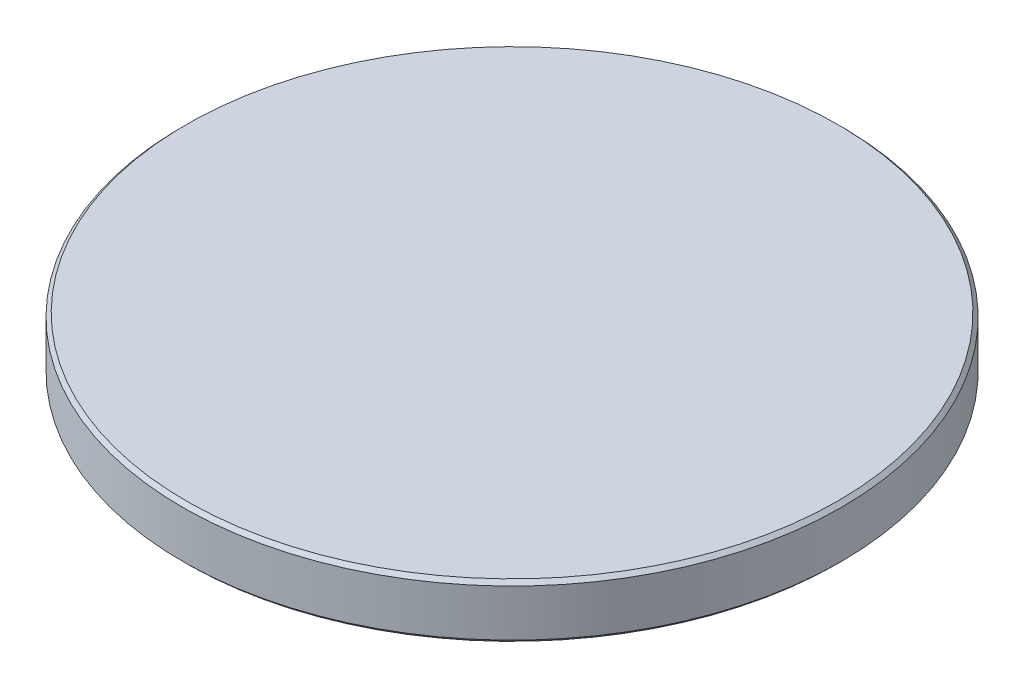
ISO-10303-21;
HEADER;
FILE_DESCRIPTION(('STEP AP214'),'2;1');
FILE_NAME('part.step','',(''),(''),'','','');
FILE_SCHEMA(('AUTOMOTIVE_DESIGN { 1 0 10303 214 1 1 1 1 }'));
ENDSEC;
DATA;
#1=APPLICATION_CONTEXT('core data for automotive mechanical design processes');
#2=APPLICATION_PROTOCOL_DEFINITION('international standard','automotive_design',2000,#1);
#3=PRODUCT_CONTEXT('',#1,'mechanical');
#4=PRODUCT('Part','Part','',(#3));
#5=PRODUCT_RELATED_PRODUCT_CATEGORY('part','',(#4));
#6=PRODUCT_DEFINITION_FORMATION('','',#4);
#7=PRODUCT_DEFINITION_CONTEXT('part definition',#1,'design');
#8=PRODUCT_DEFINITION('design','',#6,#7);
#9=PRODUCT_DEFINITION_SHAPE('','',#8);
#10=(LENGTH_UNIT() NAMED_UNIT(*) SI_UNIT(.MILLI.,.METRE.));
#11=(NAMED_UNIT(*) PLANE_ANGLE_UNIT() SI_UNIT($,.RADIAN.));
#12=(NAMED_UNIT(*) SI_UNIT($,.STERADIAN.) SOLID_ANGLE_UNIT());
#13=UNCERTAINTY_MEASURE_WITH_UNIT(LENGTH_MEASURE(1.E-05),#10,'distance_accuracy_value','');
#14=(GEOMETRIC_REPRESENTATION_CONTEXT(3) GLOBAL_UNCERTAINTY_ASSIGNED_CONTEXT((#13)) GLOBAL_UNIT_ASSIGNED_CONTEXT((#10,
#11,#12)) REPRESENTATION_CONTEXT('',''));
#15=CARTESIAN_POINT('',(0.,0.,0.));
#16=DIRECTION('',(0.,0.,1.));
#17=DIRECTION('',(1.,0.,0.));
#18=AXIS2_PLACEMENT_3D('',#15,#16,#17);
#19=CARTESIAN_POINT('',(0.,-3.08,0.));
#20=CARTESIAN_POINT('',(0.166688558981209,-3.07864785588091,0.));
#21=CARTESIAN_POINT('',(0.500196880036819,-3.07594250336388,0.));
#22=CARTESIAN_POINT('',(1.00039162887256,-3.05407480171998,0.));
#23=CARTESIAN_POINT('',(1.50058215718194,-3.01920650810453,0.));
#24=CARTESIAN_POINT('',(2.00076649141235,-2.97011018999059,0.));
#25=CARTESIAN_POINT('',(2.50094272979479,-2.90720610900806,0.));
#26=CARTESIAN_POINT('',(3.00110922823065,-2.83049989344197,0.));
#27=CARTESIAN_POINT('',(3.50126448818149,-2.74013588805335,0.));
#28=CARTESIAN_POINT('',(4.00140715717519,-2.63624820920785,0.));
#29=CARTESIAN_POINT('',(4.50153624681813,-2.51900182341059,0.));
#30=CARTESIAN_POINT('',(5.00165093424229,-2.38858053713059,0.));
#31=CARTESIAN_POINT('',(5.50175053661155,-2.24518998959466,0.));
#32=CARTESIAN_POINT('',(6.00183471553047,-2.08905759992791,0.));
#33=CARTESIAN_POINT('',(6.50190310799445,-1.92043182467319,0.));
#34=CARTESIAN_POINT('',(7.00195612117539,-1.73958392426675,0.));
#35=CARTESIAN_POINT('',(7.50199301302612,-1.54680349088638,0.));
#36=CARTESIAN_POINT('',(8.00201554375433,-1.34240665162589,0.));
#37=CARTESIAN_POINT('',(8.50202195028929,-1.12672294831204,0.));
#38=CARTESIAN_POINT('',(9.00201451451701,-0.900112371332967,0.));
#39=CARTESIAN_POINT('',(9.50199318128477,-0.662950855387774,0.));
#40=CARTESIAN_POINT('',(10.0019578800982,-0.415635557575745,0.));
#41=CARTESIAN_POINT('',(10.5019104521014,-0.158588591696318,0.));
#42=CARTESIAN_POINT('',(11.0018487545155,0.107753539531727,0.));
#43=CARTESIAN_POINT('',(11.5017839280751,0.382911001927263,0.));
#44=CARTESIAN_POINT('',(12.0016735102002,0.666471142495234,0.));
#45=CARTESIAN_POINT('',(12.3535304268543,0.871375119002351,0.));
#46=CARTESIAN_POINT('',(12.5390592557687,0.981156952125454,0.));
#47=CARTESIAN_POINT('',(12.5585786437627,0.992720719177394,0.));
#48=B_SPLINE_CURVE_WITH_KNOTS('',3,(#19,#20,#21,#22,#23,#24,#25,#26,#27,#28,#29,#30,#31,#32,#33,
#34,#35,#36,#37,#38,#39,#40,#41,#42,#43,#44,#45,#46,#47),.UNSPECIFIED.,.F.,.F.,(4,1,1,1,1,1,1,1,
1,1,1,1,1,1,1,1,1,1,1,1,1,1,1,1,1,1,4),(0.,0.036953550001872,0.0739361867135104,
0.110976750455058,0.148103592124968,0.185344338881177,0.222725664162479,0.26027308033347,
0.298010740845856,0.335961252324679,0.374145521162088,0.412582612625904,0.451289620703845,
0.490281568343083,0.529571313318874,0.569169519932965,0.609084532763862,0.649322491789022,
0.689887088316852,0.730779760087623,0.771999645136657,0.813543534446571,0.855405963268942,
0.897579285310426,0.940053576126058,0.982816824907989,0.987846654240462),.UNSPECIFIED.);
#49=CARTESIAN_POINT('',(0.,-3.08,0.));
#50=DIRECTION('',(0.,-1.,0.));
#51=AXIS1_PLACEMENT('',#49,#50);
#52=SURFACE_OF_REVOLUTION('',#48,#51);
#53=CARTESIAN_POINT('',(0.,0.992720719177391,0.));
#54=DIRECTION('',(0.,-1.,0.));
#55=DIRECTION('',(1.,0.,0.));
#56=AXIS2_PLACEMENT_3D('',#53,#54,#55);
#57=CIRCLE('',#56,12.5585786437627);
#58=CARTESIAN_POINT('',(12.5585786437627,0.992720719177394,0.));
#59=VERTEX_POINT('',#58);
#60=EDGE_CURVE('E37',#59,#59,#57,.T.);
#61=ORIENTED_EDGE('',*,*,#60,.T.);
#62=EDGE_LOOP('',(#61));
#63=FACE_BOUND('',#62,.T.);
#64=CARTESIAN_POINT('',(0.,-3.08,0.));
#65=VERTEX_POINT('',#64);
#66=VERTEX_LOOP('',#65);
#67=FACE_BOUND('',#66,.T.);
#68=ADVANCED_FACE('F15',(#63,#67),#52,.F.);
#69=CARTESIAN_POINT('',(0.,3.08,0.));
#70=DIRECTION('',(0.,1.,0.));
#71=DIRECTION('',(-1.,0.,0.));
#72=AXIS2_PLACEMENT_3D('',#69,#70,#71);
#73=PLANE('',#72);
#74=CARTESIAN_POINT('',(0.,3.08,0.));
#75=DIRECTION('',(0.,-1.,0.));
#76=DIRECTION('',(1.,0.,0.));
#77=AXIS2_PLACEMENT_3D('',#74,#75,#76);
#78=CIRCLE('',#77,12.5585786437627);
#79=CARTESIAN_POINT('',(12.5585786437627,3.08,0.));
#80=VERTEX_POINT('',#79);
#81=EDGE_CURVE('E10',#80,#80,#78,.T.);
#82=ORIENTED_EDGE('',*,*,#81,.F.);
#83=EDGE_LOOP('',(#82));
#84=FACE_BOUND('',#83,.T.);
#85=ADVANCED_FACE('F26',(#84),#73,.T.);
#86=CARTESIAN_POINT('',(0.,2.93857864376269,0.));
#87=DIRECTION('',(0.,-1.,0.));
#88=DIRECTION('',(1.,0.,0.));
#89=AXIS2_PLACEMENT_3D('',#86,#87,#88);
#90=CONICAL_SURFACE('',#89,12.7,0.785398163397467);
#91=ORIENTED_EDGE('',*,*,#81,.T.);
#92=EDGE_LOOP('',(#91));
#93=FACE_BOUND('',#92,.T.);
#94=CARTESIAN_POINT('',(0.,2.93857864376269,0.));
#95=DIRECTION('',(0.,-1.,0.));
#96=DIRECTION('',(1.,0.,0.));
#97=AXIS2_PLACEMENT_3D('',#94,#95,#96);
#98=CIRCLE('',#97,12.7);
#99=CARTESIAN_POINT('',(12.7,2.93857864376269,0.));
#100=VERTEX_POINT('',#99);
#101=EDGE_CURVE('E22',#100,#100,#98,.T.);
#102=ORIENTED_EDGE('',*,*,#101,.F.);
#103=EDGE_LOOP('',(#102));
#104=FACE_BOUND('',#103,.T.);
#105=ADVANCED_FACE('F33',(#93,#104),#90,.T.);
#106=CARTESIAN_POINT('',(0.,-3.08,0.));
#107=DIRECTION('',(0.,-1.,0.));
#108=DIRECTION('',(1.,0.,0.));
#109=AXIS2_PLACEMENT_3D('',#106,#107,#108);
#110=CYLINDRICAL_SURFACE('',#109,12.7);
#111=ORIENTED_EDGE('',*,*,#101,.T.);
#112=EDGE_LOOP('',(#111));
#113=FACE_BOUND('',#112,.T.);
#114=CARTESIAN_POINT('',(0.,1.1341420754147,0.));
#115=DIRECTION('',(0.,-1.,0.));
#116=DIRECTION('',(1.,0.,0.));
#117=AXIS2_PLACEMENT_3D('',#114,#115,#116);
#118=CIRCLE('',#117,12.7);
#119=CARTESIAN_POINT('',(12.7,1.1341420754147,0.));
#120=VERTEX_POINT('',#119);
#121=EDGE_CURVE('E39',#120,#120,#118,.T.);
#122=ORIENTED_EDGE('',*,*,#121,.F.);
#123=EDGE_LOOP('',(#122));
#124=FACE_BOUND('',#123,.T.);
#125=ADVANCED_FACE('F49',(#113,#124),#110,.T.);
#126=CARTESIAN_POINT('',(0.,0.992720719177391,0.));
#127=DIRECTION('',(0.,1.,0.));
#128=DIRECTION('',(-1.,0.,0.));
#129=AXIS2_PLACEMENT_3D('',#126,#127,#128);
#130=CONICAL_SURFACE('',#129,12.5585786437627,0.785398163397436);
#131=ORIENTED_EDGE('',*,*,#121,.T.);
#132=EDGE_LOOP('',(#131));
#133=FACE_BOUND('',#132,.T.);
#134=ORIENTED_EDGE('',*,*,#60,.F.);
#135=EDGE_LOOP('',(#134));
#136=FACE_BOUND('',#135,.T.);
#137=ADVANCED_FACE('F59',(#133,#136),#130,.T.);
#138=CLOSED_SHELL('',(#68,#85,#105,#125,#137));
#139=MANIFOLD_SOLID_BREP('B1',#138);
#140=ADVANCED_BREP_SHAPE_REPRESENTATION('',(#18,#139),#14);
#141=SHAPE_DEFINITION_REPRESENTATION(#9,#140);
ENDSEC;
END-ISO-10303-21;
